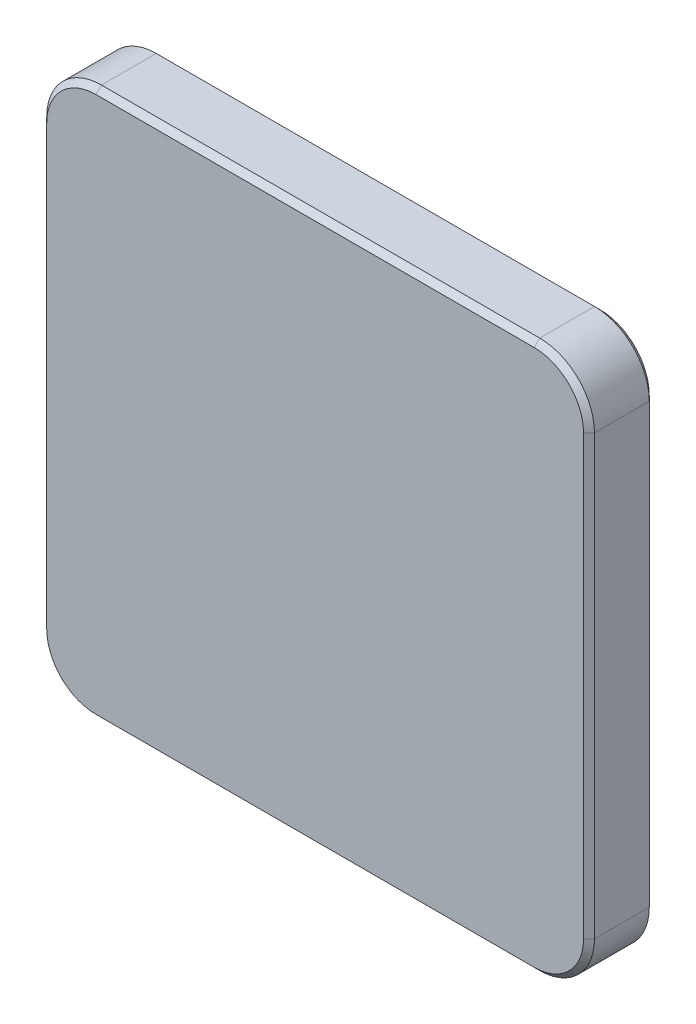
ISO-10303-21;
HEADER;
FILE_DESCRIPTION(('STEP AP214'),'2;1');
FILE_NAME('part.step','',(''),(''),'','','');
FILE_SCHEMA(('AUTOMOTIVE_DESIGN { 1 0 10303 214 1 1 1 1 }'));
ENDSEC;
DATA;
#1=APPLICATION_CONTEXT('core data for automotive mechanical design processes');
#2=APPLICATION_PROTOCOL_DEFINITION('international standard','automotive_design',2000,#1);
#3=PRODUCT_CONTEXT('',#1,'mechanical');
#4=PRODUCT('Part','Part','',(#3));
#5=PRODUCT_RELATED_PRODUCT_CATEGORY('part','',(#4));
#6=PRODUCT_DEFINITION_FORMATION('','',#4);
#7=PRODUCT_DEFINITION_CONTEXT('part definition',#1,'design');
#8=PRODUCT_DEFINITION('design','',#6,#7);
#9=PRODUCT_DEFINITION_SHAPE('','',#8);
#10=(LENGTH_UNIT() NAMED_UNIT(*) SI_UNIT(.MILLI.,.METRE.));
#11=(NAMED_UNIT(*) PLANE_ANGLE_UNIT() SI_UNIT($,.RADIAN.));
#12=(NAMED_UNIT(*) SI_UNIT($,.STERADIAN.) SOLID_ANGLE_UNIT());
#13=UNCERTAINTY_MEASURE_WITH_UNIT(LENGTH_MEASURE(1.E-05),#10,'distance_accuracy_value','');
#14=(GEOMETRIC_REPRESENTATION_CONTEXT(3) GLOBAL_UNCERTAINTY_ASSIGNED_CONTEXT((#13)) GLOBAL_UNIT_ASSIGNED_CONTEXT((#10,
#11,#12)) REPRESENTATION_CONTEXT('',''));
#15=CARTESIAN_POINT('',(0.,0.,0.));
#16=DIRECTION('',(0.,0.,1.));
#17=DIRECTION('',(1.,0.,0.));
#18=AXIS2_PLACEMENT_3D('',#15,#16,#17);
#19=CARTESIAN_POINT('',(50.,-50.,12.));
#20=DIRECTION('',(-1.,0.,0.));
#21=DIRECTION('',(0.,0.,1.));
#22=AXIS2_PLACEMENT_3D('',#19,#20,#21);
#23=PLANE('',#22);
#24=DIRECTION('',(0.,0.,-1.));
#25=VECTOR('',#24,1.);
#26=CARTESIAN_POINT('',(50.,40.,12.));
#27=LINE('',#26,#25);
#28=CARTESIAN_POINT('',(50.,40.,1.));
#29=VERTEX_POINT('',#28);
#30=CARTESIAN_POINT('',(50.,40.,11.));
#31=VERTEX_POINT('',#30);
#32=EDGE_CURVE('E294',#29,#31,#27,.F.);
#33=ORIENTED_EDGE('',*,*,#32,.T.);
#34=DIRECTION('',(0.,-1.,0.));
#35=VECTOR('',#34,1.);
#36=CARTESIAN_POINT('',(50.,-50.,11.));
#37=LINE('',#36,#35);
#38=CARTESIAN_POINT('',(50.,-40.,11.));
#39=VERTEX_POINT('',#38);
#40=EDGE_CURVE('E236',#31,#39,#37,.T.);
#41=ORIENTED_EDGE('',*,*,#40,.T.);
#42=DIRECTION('',(0.,0.,-1.));
#43=VECTOR('',#42,1.);
#44=CARTESIAN_POINT('',(50.,-40.,12.));
#45=LINE('',#44,#43);
#46=CARTESIAN_POINT('',(50.,-40.,1.));
#47=VERTEX_POINT('',#46);
#48=EDGE_CURVE('E169',#39,#47,#45,.T.);
#49=ORIENTED_EDGE('',*,*,#48,.T.);
#50=DIRECTION('',(0.,1.,0.));
#51=VECTOR('',#50,1.);
#52=CARTESIAN_POINT('',(50.,40.,1.));
#53=LINE('',#52,#51);
#54=EDGE_CURVE('E186',#47,#29,#53,.T.);
#55=ORIENTED_EDGE('',*,*,#54,.T.);
#56=EDGE_LOOP('',(#33,#41,#49,#55));
#57=FACE_BOUND('',#56,.T.);
#58=ADVANCED_FACE('F33',(#57),#23,.F.);
#59=CARTESIAN_POINT('',(-50.,50.,12.));
#60=DIRECTION('',(0.,-1.,0.));
#61=DIRECTION('',(0.,0.,-1.));
#62=AXIS2_PLACEMENT_3D('',#59,#60,#61);
#63=PLANE('',#62);
#64=DIRECTION('',(0.,0.,-1.));
#65=VECTOR('',#64,1.);
#66=CARTESIAN_POINT('',(-40.,50.,12.));
#67=LINE('',#66,#65);
#68=CARTESIAN_POINT('',(-40.,50.,1.));
#69=VERTEX_POINT('',#68);
#70=CARTESIAN_POINT('',(-40.,50.,11.));
#71=VERTEX_POINT('',#70);
#72=EDGE_CURVE('E288',#69,#71,#67,.F.);
#73=ORIENTED_EDGE('',*,*,#72,.T.);
#74=DIRECTION('',(1.,0.,0.));
#75=VECTOR('',#74,1.);
#76=CARTESIAN_POINT('',(-50.,50.,11.));
#77=LINE('',#76,#75);
#78=CARTESIAN_POINT('',(40.,50.,11.));
#79=VERTEX_POINT('',#78);
#80=EDGE_CURVE('E11',#71,#79,#77,.T.);
#81=ORIENTED_EDGE('',*,*,#80,.T.);
#82=DIRECTION('',(0.,0.,-1.));
#83=VECTOR('',#82,1.);
#84=CARTESIAN_POINT('',(40.,50.,12.));
#85=LINE('',#84,#83);
#86=CARTESIAN_POINT('',(40.,50.,1.));
#87=VERTEX_POINT('',#86);
#88=EDGE_CURVE('E284',#79,#87,#85,.T.);
#89=ORIENTED_EDGE('',*,*,#88,.T.);
#90=DIRECTION('',(-1.,0.,0.));
#91=VECTOR('',#90,1.);
#92=CARTESIAN_POINT('',(-40.,50.,1.));
#93=LINE('',#92,#91);
#94=EDGE_CURVE('E191',#87,#69,#93,.T.);
#95=ORIENTED_EDGE('',*,*,#94,.T.);
#96=EDGE_LOOP('',(#73,#81,#89,#95));
#97=FACE_BOUND('',#96,.T.);
#98=ADVANCED_FACE('F347',(#97),#63,.F.);
#99=CARTESIAN_POINT('',(-50.,-50.,12.));
#100=DIRECTION('',(1.,0.,0.));
#101=DIRECTION('',(0.,0.,-1.));
#102=AXIS2_PLACEMENT_3D('',#99,#100,#101);
#103=PLANE('',#102);
#104=DIRECTION('',(0.,0.,-1.));
#105=VECTOR('',#104,1.);
#106=CARTESIAN_POINT('',(-50.,-40.,12.));
#107=LINE('',#106,#105);
#108=CARTESIAN_POINT('',(-50.,-40.,1.));
#109=VERTEX_POINT('',#108);
#110=CARTESIAN_POINT('',(-50.,-40.,11.));
#111=VERTEX_POINT('',#110);
#112=EDGE_CURVE('E216',#109,#111,#107,.F.);
#113=ORIENTED_EDGE('',*,*,#112,.T.);
#114=DIRECTION('',(0.,1.,0.));
#115=VECTOR('',#114,1.);
#116=CARTESIAN_POINT('',(-50.,-50.,11.));
#117=LINE('',#116,#115);
#118=CARTESIAN_POINT('',(-50.,40.,11.));
#119=VERTEX_POINT('',#118);
#120=EDGE_CURVE('E57',#111,#119,#117,.T.);
#121=ORIENTED_EDGE('',*,*,#120,.T.);
#122=DIRECTION('',(0.,0.,-1.));
#123=VECTOR('',#122,1.);
#124=CARTESIAN_POINT('',(-50.,40.,12.));
#125=LINE('',#124,#123);
#126=CARTESIAN_POINT('',(-50.,40.,1.));
#127=VERTEX_POINT('',#126);
#128=EDGE_CURVE('E282',#119,#127,#125,.T.);
#129=ORIENTED_EDGE('',*,*,#128,.T.);
#130=DIRECTION('',(0.,-1.,0.));
#131=VECTOR('',#130,1.);
#132=CARTESIAN_POINT('',(-50.,-40.,1.));
#133=LINE('',#132,#131);
#134=EDGE_CURVE('E196',#127,#109,#133,.T.);
#135=ORIENTED_EDGE('',*,*,#134,.T.);
#136=EDGE_LOOP('',(#113,#121,#129,#135));
#137=FACE_BOUND('',#136,.T.);
#138=ADVANCED_FACE('F281',(#137),#103,.F.);
#139=CARTESIAN_POINT('',(-50.,-50.,12.));
#140=DIRECTION('',(0.,1.,0.));
#141=DIRECTION('',(0.,0.,1.));
#142=AXIS2_PLACEMENT_3D('',#139,#140,#141);
#143=PLANE('',#142);
#144=DIRECTION('',(0.,0.,-1.));
#145=VECTOR('',#144,1.);
#146=CARTESIAN_POINT('',(40.,-50.,12.));
#147=LINE('',#146,#145);
#148=CARTESIAN_POINT('',(40.,-50.,1.));
#149=VERTEX_POINT('',#148);
#150=CARTESIAN_POINT('',(40.,-50.,11.));
#151=VERTEX_POINT('',#150);
#152=EDGE_CURVE('E290',#149,#151,#147,.F.);
#153=ORIENTED_EDGE('',*,*,#152,.T.);
#154=DIRECTION('',(-1.,0.,0.));
#155=VECTOR('',#154,1.);
#156=CARTESIAN_POINT('',(-50.,-50.,11.));
#157=LINE('',#156,#155);
#158=CARTESIAN_POINT('',(-40.,-50.,11.));
#159=VERTEX_POINT('',#158);
#160=EDGE_CURVE('E240',#151,#159,#157,.T.);
#161=ORIENTED_EDGE('',*,*,#160,.T.);
#162=DIRECTION('',(0.,0.,-1.));
#163=VECTOR('',#162,1.);
#164=CARTESIAN_POINT('',(-40.,-50.,12.));
#165=LINE('',#164,#163);
#166=CARTESIAN_POINT('',(-40.,-50.,1.));
#167=VERTEX_POINT('',#166);
#168=EDGE_CURVE('E280',#159,#167,#165,.T.);
#169=ORIENTED_EDGE('',*,*,#168,.T.);
#170=DIRECTION('',(1.,0.,0.));
#171=VECTOR('',#170,1.);
#172=CARTESIAN_POINT('',(40.,-50.,1.));
#173=LINE('',#172,#171);
#174=EDGE_CURVE('E176',#167,#149,#173,.T.);
#175=ORIENTED_EDGE('',*,*,#174,.T.);
#176=EDGE_LOOP('',(#153,#161,#169,#175));
#177=FACE_BOUND('',#176,.T.);
#178=ADVANCED_FACE('F316',(#177),#143,.F.);
#179=CARTESIAN_POINT('',(0.,0.,12.));
#180=DIRECTION('',(0.,0.,-1.));
#181=DIRECTION('',(-1.,0.,0.));
#182=AXIS2_PLACEMENT_3D('',#179,#180,#181);
#183=PLANE('',#182);
#184=DIRECTION('',(0.,1.,0.));
#185=VECTOR('',#184,1.);
#186=CARTESIAN_POINT('',(49.,0.,12.));
#187=LINE('',#186,#185);
#188=CARTESIAN_POINT('',(49.,-40.,12.));
#189=VERTEX_POINT('',#188);
#190=CARTESIAN_POINT('',(49.,40.,12.));
#191=VERTEX_POINT('',#190);
#192=EDGE_CURVE('E228',#189,#191,#187,.T.);
#193=ORIENTED_EDGE('',*,*,#192,.T.);
#194=CARTESIAN_POINT('',(40.,40.,12.));
#195=DIRECTION('',(0.,0.,-1.));
#196=DIRECTION('',(-1.,0.,0.));
#197=AXIS2_PLACEMENT_3D('',#194,#195,#196);
#198=CIRCLE('',#197,8.99999999999999);
#199=CARTESIAN_POINT('',(40.,49.,12.));
#200=VERTEX_POINT('',#199);
#201=EDGE_CURVE('E230',#191,#200,#198,.F.);
#202=ORIENTED_EDGE('',*,*,#201,.T.);
#203=DIRECTION('',(-1.,0.,0.));
#204=VECTOR('',#203,1.);
#205=CARTESIAN_POINT('',(0.,49.,12.));
#206=LINE('',#205,#204);
#207=CARTESIAN_POINT('',(-40.,49.,12.));
#208=VERTEX_POINT('',#207);
#209=EDGE_CURVE('E197',#200,#208,#206,.T.);
#210=ORIENTED_EDGE('',*,*,#209,.T.);
#211=CARTESIAN_POINT('',(-40.,40.,12.));
#212=DIRECTION('',(0.,0.,-1.));
#213=DIRECTION('',(-1.,0.,0.));
#214=AXIS2_PLACEMENT_3D('',#211,#212,#213);
#215=CIRCLE('',#214,8.99999999999999);
#216=CARTESIAN_POINT('',(-49.,40.,12.));
#217=VERTEX_POINT('',#216);
#218=EDGE_CURVE('E218',#208,#217,#215,.F.);
#219=ORIENTED_EDGE('',*,*,#218,.T.);
#220=DIRECTION('',(0.,-1.,0.));
#221=VECTOR('',#220,1.);
#222=CARTESIAN_POINT('',(-49.,0.,12.));
#223=LINE('',#222,#221);
#224=CARTESIAN_POINT('',(-49.,-40.,12.));
#225=VERTEX_POINT('',#224);
#226=EDGE_CURVE('E220',#217,#225,#223,.T.);
#227=ORIENTED_EDGE('',*,*,#226,.T.);
#228=CARTESIAN_POINT('',(-40.,-40.,12.));
#229=DIRECTION('',(0.,0.,-1.));
#230=DIRECTION('',(-1.,0.,0.));
#231=AXIS2_PLACEMENT_3D('',#228,#229,#230);
#232=CIRCLE('',#231,8.99999999999999);
#233=CARTESIAN_POINT('',(-40.,-49.,12.));
#234=VERTEX_POINT('',#233);
#235=EDGE_CURVE('E222',#225,#234,#232,.F.);
#236=ORIENTED_EDGE('',*,*,#235,.T.);
#237=DIRECTION('',(1.,0.,0.));
#238=VECTOR('',#237,1.);
#239=CARTESIAN_POINT('',(0.,-49.,12.));
#240=LINE('',#239,#238);
#241=CARTESIAN_POINT('',(40.,-49.,12.));
#242=VERTEX_POINT('',#241);
#243=EDGE_CURVE('E224',#234,#242,#240,.T.);
#244=ORIENTED_EDGE('',*,*,#243,.T.);
#245=CARTESIAN_POINT('',(40.,-40.,12.));
#246=DIRECTION('',(0.,0.,-1.));
#247=DIRECTION('',(-1.,0.,0.));
#248=AXIS2_PLACEMENT_3D('',#245,#246,#247);
#249=CIRCLE('',#248,8.99999999999999);
#250=EDGE_CURVE('E226',#242,#189,#249,.F.);
#251=ORIENTED_EDGE('',*,*,#250,.T.);
#252=EDGE_LOOP('',(#193,#202,#210,#219,#227,#236,#244,#251));
#253=FACE_BOUND('',#252,.T.);
#254=ADVANCED_FACE('F333',(#253),#183,.F.);
#255=CARTESIAN_POINT('',(0.,0.,0.));
#256=DIRECTION('',(0.,0.,-1.));
#257=DIRECTION('',(-1.,0.,0.));
#258=AXIS2_PLACEMENT_3D('',#255,#256,#257);
#259=PLANE('',#258);
#260=DIRECTION('',(-1.,0.,0.));
#261=VECTOR('',#260,1.);
#262=CARTESIAN_POINT('',(-40.,-49.,0.));
#263=LINE('',#262,#261);
#264=CARTESIAN_POINT('',(40.,-49.,0.));
#265=VERTEX_POINT('',#264);
#266=CARTESIAN_POINT('',(-40.,-49.,0.));
#267=VERTEX_POINT('',#266);
#268=EDGE_CURVE('E173',#265,#267,#263,.T.);
#269=ORIENTED_EDGE('',*,*,#268,.T.);
#270=CARTESIAN_POINT('',(-40.,-40.,0.));
#271=DIRECTION('',(0.,0.,-1.));
#272=DIRECTION('',(-1.,0.,0.));
#273=AXIS2_PLACEMENT_3D('',#270,#271,#272);
#274=CIRCLE('',#273,9.);
#275=CARTESIAN_POINT('',(-49.,-40.,0.));
#276=VERTEX_POINT('',#275);
#277=EDGE_CURVE('E154',#267,#276,#274,.T.);
#278=ORIENTED_EDGE('',*,*,#277,.T.);
#279=DIRECTION('',(0.,1.,0.));
#280=VECTOR('',#279,1.);
#281=CARTESIAN_POINT('',(-49.,40.,0.));
#282=LINE('',#281,#280);
#283=CARTESIAN_POINT('',(-49.,40.,0.));
#284=VERTEX_POINT('',#283);
#285=EDGE_CURVE('E162',#276,#284,#282,.T.);
#286=ORIENTED_EDGE('',*,*,#285,.T.);
#287=CARTESIAN_POINT('',(-40.,40.,0.));
#288=DIRECTION('',(0.,0.,-1.));
#289=DIRECTION('',(-1.,0.,0.));
#290=AXIS2_PLACEMENT_3D('',#287,#288,#289);
#291=CIRCLE('',#290,9.);
#292=CARTESIAN_POINT('',(-40.,49.,0.));
#293=VERTEX_POINT('',#292);
#294=EDGE_CURVE('E168',#284,#293,#291,.T.);
#295=ORIENTED_EDGE('',*,*,#294,.T.);
#296=DIRECTION('',(1.,0.,0.));
#297=VECTOR('',#296,1.);
#298=CARTESIAN_POINT('',(40.,49.,0.));
#299=LINE('',#298,#297);
#300=CARTESIAN_POINT('',(40.,49.,0.));
#301=VERTEX_POINT('',#300);
#302=EDGE_CURVE('E299',#293,#301,#299,.T.);
#303=ORIENTED_EDGE('',*,*,#302,.T.);
#304=CARTESIAN_POINT('',(40.,40.,0.));
#305=DIRECTION('',(0.,0.,-1.));
#306=DIRECTION('',(-1.,0.,0.));
#307=AXIS2_PLACEMENT_3D('',#304,#305,#306);
#308=CIRCLE('',#307,9.);
#309=CARTESIAN_POINT('',(49.,40.,0.));
#310=VERTEX_POINT('',#309);
#311=EDGE_CURVE('E301',#301,#310,#308,.T.);
#312=ORIENTED_EDGE('',*,*,#311,.T.);
#313=DIRECTION('',(0.,-1.,0.));
#314=VECTOR('',#313,1.);
#315=CARTESIAN_POINT('',(49.,-40.,0.));
#316=LINE('',#315,#314);
#317=CARTESIAN_POINT('',(49.,-40.,0.));
#318=VERTEX_POINT('',#317);
#319=EDGE_CURVE('E303',#310,#318,#316,.T.);
#320=ORIENTED_EDGE('',*,*,#319,.T.);
#321=CARTESIAN_POINT('',(40.,-40.,0.));
#322=DIRECTION('',(0.,0.,-1.));
#323=DIRECTION('',(-1.,0.,0.));
#324=AXIS2_PLACEMENT_3D('',#321,#322,#323);
#325=CIRCLE('',#324,9.);
#326=EDGE_CURVE('E178',#318,#265,#325,.T.);
#327=ORIENTED_EDGE('',*,*,#326,.T.);
#328=EDGE_LOOP('',(#269,#278,#286,#295,#303,#312,#320,#327));
#329=FACE_BOUND('',#328,.T.);
#330=ADVANCED_FACE('F171',(#329),#259,.T.);
#331=CARTESIAN_POINT('',(-40.,40.,12.));
#332=DIRECTION('',(0.,0.,-1.));
#333=DIRECTION('',(-1.,0.,0.));
#334=AXIS2_PLACEMENT_3D('',#331,#332,#333);
#335=CYLINDRICAL_SURFACE('',#334,10.);
#336=ORIENTED_EDGE('',*,*,#128,.F.);
#337=CARTESIAN_POINT('',(-40.,40.,11.));
#338=DIRECTION('',(0.,0.,-1.));
#339=DIRECTION('',(-1.,0.,0.));
#340=AXIS2_PLACEMENT_3D('',#337,#338,#339);
#341=CIRCLE('',#340,10.);
#342=EDGE_CURVE('E42',#119,#71,#341,.T.);
#343=ORIENTED_EDGE('',*,*,#342,.T.);
#344=ORIENTED_EDGE('',*,*,#72,.F.);
#345=CARTESIAN_POINT('',(-40.,40.,1.));
#346=DIRECTION('',(0.,0.,-1.));
#347=DIRECTION('',(-1.,0.,0.));
#348=AXIS2_PLACEMENT_3D('',#345,#346,#347);
#349=CIRCLE('',#348,10.);
#350=EDGE_CURVE('E193',#69,#127,#349,.F.);
#351=ORIENTED_EDGE('',*,*,#350,.T.);
#352=EDGE_LOOP('',(#336,#343,#344,#351));
#353=FACE_BOUND('',#352,.T.);
#354=ADVANCED_FACE('F372',(#353),#335,.T.);
#355=CARTESIAN_POINT('',(-40.,-40.,12.));
#356=DIRECTION('',(0.,0.,-1.));
#357=DIRECTION('',(-1.,0.,0.));
#358=AXIS2_PLACEMENT_3D('',#355,#356,#357);
#359=CYLINDRICAL_SURFACE('',#358,10.);
#360=ORIENTED_EDGE('',*,*,#168,.F.);
#361=CARTESIAN_POINT('',(-40.,-40.,11.));
#362=DIRECTION('',(0.,0.,-1.));
#363=DIRECTION('',(-1.,0.,0.));
#364=AXIS2_PLACEMENT_3D('',#361,#362,#363);
#365=CIRCLE('',#364,10.);
#366=EDGE_CURVE('E242',#159,#111,#365,.T.);
#367=ORIENTED_EDGE('',*,*,#366,.T.);
#368=ORIENTED_EDGE('',*,*,#112,.F.);
#369=CARTESIAN_POINT('',(-40.,-40.,1.));
#370=DIRECTION('',(0.,0.,-1.));
#371=DIRECTION('',(-1.,0.,0.));
#372=AXIS2_PLACEMENT_3D('',#369,#370,#371);
#373=CIRCLE('',#372,10.);
#374=EDGE_CURVE('E156',#109,#167,#373,.F.);
#375=ORIENTED_EDGE('',*,*,#374,.T.);
#376=EDGE_LOOP('',(#360,#367,#368,#375));
#377=FACE_BOUND('',#376,.T.);
#378=ADVANCED_FACE('F279',(#377),#359,.T.);
#379=CARTESIAN_POINT('',(40.,-40.,12.));
#380=DIRECTION('',(0.,0.,-1.));
#381=DIRECTION('',(-1.,0.,0.));
#382=AXIS2_PLACEMENT_3D('',#379,#380,#381);
#383=CYLINDRICAL_SURFACE('',#382,10.);
#384=ORIENTED_EDGE('',*,*,#48,.F.);
#385=CARTESIAN_POINT('',(40.,-40.,11.));
#386=DIRECTION('',(0.,0.,-1.));
#387=DIRECTION('',(-1.,0.,0.));
#388=AXIS2_PLACEMENT_3D('',#385,#386,#387);
#389=CIRCLE('',#388,10.);
#390=EDGE_CURVE('E238',#39,#151,#389,.T.);
#391=ORIENTED_EDGE('',*,*,#390,.T.);
#392=ORIENTED_EDGE('',*,*,#152,.F.);
#393=CARTESIAN_POINT('',(40.,-40.,1.));
#394=DIRECTION('',(0.,0.,-1.));
#395=DIRECTION('',(-1.,0.,0.));
#396=AXIS2_PLACEMENT_3D('',#393,#394,#395);
#397=CIRCLE('',#396,10.);
#398=EDGE_CURVE('E183',#149,#47,#397,.F.);
#399=ORIENTED_EDGE('',*,*,#398,.T.);
#400=EDGE_LOOP('',(#384,#391,#392,#399));
#401=FACE_BOUND('',#400,.T.);
#402=ADVANCED_FACE('F319',(#401),#383,.T.);
#403=CARTESIAN_POINT('',(40.,40.,12.));
#404=DIRECTION('',(0.,0.,-1.));
#405=DIRECTION('',(-1.,0.,0.));
#406=AXIS2_PLACEMENT_3D('',#403,#404,#405);
#407=CYLINDRICAL_SURFACE('',#406,10.);
#408=ORIENTED_EDGE('',*,*,#88,.F.);
#409=CARTESIAN_POINT('',(40.,40.,11.));
#410=DIRECTION('',(0.,0.,-1.));
#411=DIRECTION('',(-1.,0.,0.));
#412=AXIS2_PLACEMENT_3D('',#409,#410,#411);
#413=CIRCLE('',#412,10.);
#414=EDGE_CURVE('E233',#79,#31,#413,.T.);
#415=ORIENTED_EDGE('',*,*,#414,.T.);
#416=ORIENTED_EDGE('',*,*,#32,.F.);
#417=CARTESIAN_POINT('',(40.,40.,1.));
#418=DIRECTION('',(0.,0.,-1.));
#419=DIRECTION('',(-1.,0.,0.));
#420=AXIS2_PLACEMENT_3D('',#417,#418,#419);
#421=CIRCLE('',#420,10.);
#422=EDGE_CURVE('E188',#29,#87,#421,.F.);
#423=ORIENTED_EDGE('',*,*,#422,.T.);
#424=EDGE_LOOP('',(#408,#415,#416,#423));
#425=FACE_BOUND('',#424,.T.);
#426=ADVANCED_FACE('F350',(#425),#407,.T.);
#427=CARTESIAN_POINT('',(40.,40.,0.));
#428=DIRECTION('',(0.,0.,1.));
#429=DIRECTION('',(1.,0.,0.));
#430=AXIS2_PLACEMENT_3D('',#427,#428,#429);
#431=CONICAL_SURFACE('',#430,9.,0.785398163397447);
#432=DIRECTION('',(0.,-0.707106781186547,-0.707106781186547));
#433=VECTOR('',#432,1.);
#434=CARTESIAN_POINT('',(40.,50.,1.));
#435=LINE('',#434,#433);
#436=EDGE_CURVE('E210',#87,#301,#435,.T.);
#437=ORIENTED_EDGE('',*,*,#436,.F.);
#438=ORIENTED_EDGE('',*,*,#422,.F.);
#439=DIRECTION('',(0.707106781186547,0.,0.707106781186547));
#440=VECTOR('',#439,1.);
#441=CARTESIAN_POINT('',(49.,40.,0.));
#442=LINE('',#441,#440);
#443=EDGE_CURVE('E213',#310,#29,#442,.T.);
#444=ORIENTED_EDGE('',*,*,#443,.F.);
#445=ORIENTED_EDGE('',*,*,#311,.F.);
#446=EDGE_LOOP('',(#437,#438,#444,#445));
#447=FACE_BOUND('',#446,.T.);
#448=ADVANCED_FACE('F381',(#447),#431,.T.);
#449=CARTESIAN_POINT('',(50.,-50.,1.));
#450=DIRECTION('',(0.707106781186547,0.,-0.707106781186547));
#451=DIRECTION('',(0.,-1.,0.));
#452=AXIS2_PLACEMENT_3D('',#449,#450,#451);
#453=PLANE('',#452);
#454=ORIENTED_EDGE('',*,*,#443,.T.);
#455=ORIENTED_EDGE('',*,*,#54,.F.);
#456=DIRECTION('',(0.707106781186547,0.,0.707106781186547));
#457=VECTOR('',#456,1.);
#458=CARTESIAN_POINT('',(49.,-40.,0.));
#459=LINE('',#458,#457);
#460=EDGE_CURVE('E207',#318,#47,#459,.T.);
#461=ORIENTED_EDGE('',*,*,#460,.F.);
#462=ORIENTED_EDGE('',*,*,#319,.F.);
#463=EDGE_LOOP('',(#454,#455,#461,#462));
#464=FACE_BOUND('',#463,.T.);
#465=ADVANCED_FACE('F397',(#464),#453,.T.);
#466=CARTESIAN_POINT('',(-50.,50.,1.));
#467=DIRECTION('',(0.,0.707106781186547,-0.707106781186547));
#468=DIRECTION('',(1.,0.,0.));
#469=AXIS2_PLACEMENT_3D('',#466,#467,#468);
#470=PLANE('',#469);
#471=ORIENTED_EDGE('',*,*,#436,.T.);
#472=ORIENTED_EDGE('',*,*,#302,.F.);
#473=DIRECTION('',(0.,-0.707106781186547,-0.707106781186547));
#474=VECTOR('',#473,1.);
#475=CARTESIAN_POINT('',(-40.,50.,1.));
#476=LINE('',#475,#474);
#477=EDGE_CURVE('E204',#69,#293,#476,.T.);
#478=ORIENTED_EDGE('',*,*,#477,.F.);
#479=ORIENTED_EDGE('',*,*,#94,.F.);
#480=EDGE_LOOP('',(#471,#472,#478,#479));
#481=FACE_BOUND('',#480,.T.);
#482=ADVANCED_FACE('F394',(#481),#470,.T.);
#483=CARTESIAN_POINT('',(40.,-40.,0.));
#484=DIRECTION('',(0.,0.,1.));
#485=DIRECTION('',(1.,0.,0.));
#486=AXIS2_PLACEMENT_3D('',#483,#484,#485);
#487=CONICAL_SURFACE('',#486,9.,0.785398163397447);
#488=ORIENTED_EDGE('',*,*,#460,.T.);
#489=ORIENTED_EDGE('',*,*,#398,.F.);
#490=DIRECTION('',(0.,-0.707106781186547,0.707106781186547));
#491=VECTOR('',#490,1.);
#492=CARTESIAN_POINT('',(40.,-49.,0.));
#493=LINE('',#492,#491);
#494=EDGE_CURVE('E201',#265,#149,#493,.T.);
#495=ORIENTED_EDGE('',*,*,#494,.F.);
#496=ORIENTED_EDGE('',*,*,#326,.F.);
#497=EDGE_LOOP('',(#488,#489,#495,#496));
#498=FACE_BOUND('',#497,.T.);
#499=ADVANCED_FACE('F310',(#498),#487,.T.);
#500=CARTESIAN_POINT('',(-40.,40.,0.));
#501=DIRECTION('',(0.,0.,1.));
#502=DIRECTION('',(1.,0.,0.));
#503=AXIS2_PLACEMENT_3D('',#500,#501,#502);
#504=CONICAL_SURFACE('',#503,9.,0.785398163397447);
#505=ORIENTED_EDGE('',*,*,#477,.T.);
#506=ORIENTED_EDGE('',*,*,#294,.F.);
#507=DIRECTION('',(0.707106781186547,0.,-0.707106781186547));
#508=VECTOR('',#507,1.);
#509=CARTESIAN_POINT('',(-50.,40.,1.));
#510=LINE('',#509,#508);
#511=EDGE_CURVE('E165',#127,#284,#510,.T.);
#512=ORIENTED_EDGE('',*,*,#511,.F.);
#513=ORIENTED_EDGE('',*,*,#350,.F.);
#514=EDGE_LOOP('',(#505,#506,#512,#513));
#515=FACE_BOUND('',#514,.T.);
#516=ADVANCED_FACE('F388',(#515),#504,.T.);
#517=CARTESIAN_POINT('',(-50.,-50.,1.));
#518=DIRECTION('',(0.,-0.707106781186547,-0.707106781186547));
#519=DIRECTION('',(-1.,0.,0.));
#520=AXIS2_PLACEMENT_3D('',#517,#518,#519);
#521=PLANE('',#520);
#522=ORIENTED_EDGE('',*,*,#494,.T.);
#523=ORIENTED_EDGE('',*,*,#174,.F.);
#524=DIRECTION('',(0.,-0.707106781186547,0.707106781186547));
#525=VECTOR('',#524,1.);
#526=CARTESIAN_POINT('',(-40.,-49.,0.));
#527=LINE('',#526,#525);
#528=EDGE_CURVE('E159',#267,#167,#527,.T.);
#529=ORIENTED_EDGE('',*,*,#528,.F.);
#530=ORIENTED_EDGE('',*,*,#268,.F.);
#531=EDGE_LOOP('',(#522,#523,#529,#530));
#532=FACE_BOUND('',#531,.T.);
#533=ADVANCED_FACE('F313',(#532),#521,.T.);
#534=CARTESIAN_POINT('',(-50.,-50.,1.));
#535=DIRECTION('',(-0.707106781186547,0.,-0.707106781186547));
#536=DIRECTION('',(0.,1.,0.));
#537=AXIS2_PLACEMENT_3D('',#534,#535,#536);
#538=PLANE('',#537);
#539=ORIENTED_EDGE('',*,*,#511,.T.);
#540=ORIENTED_EDGE('',*,*,#285,.F.);
#541=DIRECTION('',(0.707106781186547,0.,-0.707106781186547));
#542=VECTOR('',#541,1.);
#543=CARTESIAN_POINT('',(-50.,-40.,1.));
#544=LINE('',#543,#542);
#545=EDGE_CURVE('E149',#109,#276,#544,.T.);
#546=ORIENTED_EDGE('',*,*,#545,.F.);
#547=ORIENTED_EDGE('',*,*,#134,.F.);
#548=EDGE_LOOP('',(#539,#540,#546,#547));
#549=FACE_BOUND('',#548,.T.);
#550=ADVANCED_FACE('F163',(#549),#538,.T.);
#551=CARTESIAN_POINT('',(-40.,-40.,0.));
#552=DIRECTION('',(0.,0.,1.));
#553=DIRECTION('',(1.,0.,0.));
#554=AXIS2_PLACEMENT_3D('',#551,#552,#553);
#555=CONICAL_SURFACE('',#554,9.,0.785398163397447);
#556=ORIENTED_EDGE('',*,*,#528,.T.);
#557=ORIENTED_EDGE('',*,*,#374,.F.);
#558=ORIENTED_EDGE('',*,*,#545,.T.);
#559=ORIENTED_EDGE('',*,*,#277,.F.);
#560=EDGE_LOOP('',(#556,#557,#558,#559));
#561=FACE_BOUND('',#560,.T.);
#562=ADVANCED_FACE('F152',(#561),#555,.T.);
#563=CARTESIAN_POINT('',(-40.,-40.,12.));
#564=DIRECTION('',(0.,0.,-1.));
#565=DIRECTION('',(-1.,0.,0.));
#566=AXIS2_PLACEMENT_3D('',#563,#564,#565);
#567=CONICAL_SURFACE('',#566,8.99999999999999,0.785398163397447);
#568=DIRECTION('',(0.707106781186547,0.,0.707106781186547));
#569=VECTOR('',#568,1.);
#570=CARTESIAN_POINT('',(-50.,-40.,11.));
#571=LINE('',#570,#569);
#572=EDGE_CURVE('E261',#111,#225,#571,.T.);
#573=ORIENTED_EDGE('',*,*,#572,.F.);
#574=ORIENTED_EDGE('',*,*,#366,.F.);
#575=DIRECTION('',(0.,-0.707106781186547,-0.707106781186547));
#576=VECTOR('',#575,1.);
#577=CARTESIAN_POINT('',(-40.,-49.,12.));
#578=LINE('',#577,#576);
#579=EDGE_CURVE('E37',#234,#159,#578,.T.);
#580=ORIENTED_EDGE('',*,*,#579,.F.);
#581=ORIENTED_EDGE('',*,*,#235,.F.);
#582=EDGE_LOOP('',(#573,#574,#580,#581));
#583=FACE_BOUND('',#582,.T.);
#584=ADVANCED_FACE('F35',(#583),#567,.T.);
#585=CARTESIAN_POINT('',(0.,-49.,12.));
#586=DIRECTION('',(0.,0.707106781186547,-0.707106781186547));
#587=DIRECTION('',(1.,0.,0.));
#588=AXIS2_PLACEMENT_3D('',#585,#586,#587);
#589=PLANE('',#588);
#590=ORIENTED_EDGE('',*,*,#579,.T.);
#591=ORIENTED_EDGE('',*,*,#160,.F.);
#592=DIRECTION('',(0.,-0.707106781186547,-0.707106781186547));
#593=VECTOR('',#592,1.);
#594=CARTESIAN_POINT('',(40.,-49.,12.));
#595=LINE('',#594,#593);
#596=EDGE_CURVE('E259',#242,#151,#595,.T.);
#597=ORIENTED_EDGE('',*,*,#596,.F.);
#598=ORIENTED_EDGE('',*,*,#243,.F.);
#599=EDGE_LOOP('',(#590,#591,#597,#598));
#600=FACE_BOUND('',#599,.T.);
#601=ADVANCED_FACE('F271',(#600),#589,.F.);
#602=CARTESIAN_POINT('',(-49.,0.,12.));
#603=DIRECTION('',(0.707106781186547,0.,-0.707106781186547));
#604=DIRECTION('',(0.,-1.,0.));
#605=AXIS2_PLACEMENT_3D('',#602,#603,#604);
#606=PLANE('',#605);
#607=ORIENTED_EDGE('',*,*,#572,.T.);
#608=ORIENTED_EDGE('',*,*,#226,.F.);
#609=DIRECTION('',(0.707106781186547,0.,0.707106781186547));
#610=VECTOR('',#609,1.);
#611=CARTESIAN_POINT('',(-50.,40.,11.));
#612=LINE('',#611,#610);
#613=EDGE_CURVE('E256',#119,#217,#612,.T.);
#614=ORIENTED_EDGE('',*,*,#613,.F.);
#615=ORIENTED_EDGE('',*,*,#120,.F.);
#616=EDGE_LOOP('',(#607,#608,#614,#615));
#617=FACE_BOUND('',#616,.T.);
#618=ADVANCED_FACE('F336',(#617),#606,.F.);
#619=CARTESIAN_POINT('',(40.,-40.,12.));
#620=DIRECTION('',(0.,0.,-1.));
#621=DIRECTION('',(-1.,0.,0.));
#622=AXIS2_PLACEMENT_3D('',#619,#620,#621);
#623=CONICAL_SURFACE('',#622,8.99999999999999,0.785398163397447);
#624=ORIENTED_EDGE('',*,*,#596,.T.);
#625=ORIENTED_EDGE('',*,*,#390,.F.);
#626=DIRECTION('',(0.707106781186547,0.,-0.707106781186547));
#627=VECTOR('',#626,1.);
#628=CARTESIAN_POINT('',(49.,-40.,12.));
#629=LINE('',#628,#627);
#630=EDGE_CURVE('E253',#189,#39,#629,.T.);
#631=ORIENTED_EDGE('',*,*,#630,.F.);
#632=ORIENTED_EDGE('',*,*,#250,.F.);
#633=EDGE_LOOP('',(#624,#625,#631,#632));
#634=FACE_BOUND('',#633,.T.);
#635=ADVANCED_FACE('F324',(#634),#623,.T.);
#636=CARTESIAN_POINT('',(-40.,40.,12.));
#637=DIRECTION('',(0.,0.,-1.));
#638=DIRECTION('',(-1.,0.,0.));
#639=AXIS2_PLACEMENT_3D('',#636,#637,#638);
#640=CONICAL_SURFACE('',#639,8.99999999999999,0.785398163397447);
#641=ORIENTED_EDGE('',*,*,#613,.T.);
#642=ORIENTED_EDGE('',*,*,#218,.F.);
#643=DIRECTION('',(0.,-0.707106781186547,0.707106781186547));
#644=VECTOR('',#643,1.);
#645=CARTESIAN_POINT('',(-40.,50.,11.));
#646=LINE('',#645,#644);
#647=EDGE_CURVE('E250',#71,#208,#646,.T.);
#648=ORIENTED_EDGE('',*,*,#647,.F.);
#649=ORIENTED_EDGE('',*,*,#342,.F.);
#650=EDGE_LOOP('',(#641,#642,#648,#649));
#651=FACE_BOUND('',#650,.T.);
#652=ADVANCED_FACE('F338',(#651),#640,.T.);
#653=CARTESIAN_POINT('',(49.,0.,12.));
#654=DIRECTION('',(-0.707106781186547,0.,-0.707106781186547));
#655=DIRECTION('',(0.,1.,0.));
#656=AXIS2_PLACEMENT_3D('',#653,#654,#655);
#657=PLANE('',#656);
#658=ORIENTED_EDGE('',*,*,#630,.T.);
#659=ORIENTED_EDGE('',*,*,#40,.F.);
#660=DIRECTION('',(0.707106781186547,0.,-0.707106781186547));
#661=VECTOR('',#660,1.);
#662=CARTESIAN_POINT('',(49.,40.,12.));
#663=LINE('',#662,#661);
#664=EDGE_CURVE('E248',#191,#31,#663,.T.);
#665=ORIENTED_EDGE('',*,*,#664,.F.);
#666=ORIENTED_EDGE('',*,*,#192,.F.);
#667=EDGE_LOOP('',(#658,#659,#665,#666));
#668=FACE_BOUND('',#667,.T.);
#669=ADVANCED_FACE('F329',(#668),#657,.F.);
#670=CARTESIAN_POINT('',(0.,49.,12.));
#671=DIRECTION('',(0.,-0.707106781186547,-0.707106781186547));
#672=DIRECTION('',(-1.,0.,0.));
#673=AXIS2_PLACEMENT_3D('',#670,#671,#672);
#674=PLANE('',#673);
#675=ORIENTED_EDGE('',*,*,#647,.T.);
#676=ORIENTED_EDGE('',*,*,#209,.F.);
#677=DIRECTION('',(0.,-0.707106781186547,0.707106781186547));
#678=VECTOR('',#677,1.);
#679=CARTESIAN_POINT('',(40.,50.,11.));
#680=LINE('',#679,#678);
#681=EDGE_CURVE('E246',#79,#200,#680,.T.);
#682=ORIENTED_EDGE('',*,*,#681,.F.);
#683=ORIENTED_EDGE('',*,*,#80,.F.);
#684=EDGE_LOOP('',(#675,#676,#682,#683));
#685=FACE_BOUND('',#684,.T.);
#686=ADVANCED_FACE('F344',(#685),#674,.F.);
#687=CARTESIAN_POINT('',(40.,40.,12.));
#688=DIRECTION('',(0.,0.,-1.));
#689=DIRECTION('',(-1.,0.,0.));
#690=AXIS2_PLACEMENT_3D('',#687,#688,#689);
#691=CONICAL_SURFACE('',#690,8.99999999999999,0.785398163397447);
#692=ORIENTED_EDGE('',*,*,#664,.T.);
#693=ORIENTED_EDGE('',*,*,#414,.F.);
#694=ORIENTED_EDGE('',*,*,#681,.T.);
#695=ORIENTED_EDGE('',*,*,#201,.F.);
#696=EDGE_LOOP('',(#692,#693,#694,#695));
#697=FACE_BOUND('',#696,.T.);
#698=ADVANCED_FACE('F355',(#697),#691,.T.);
#699=CLOSED_SHELL('',(#58,#98,#138,#178,#254,#330,#354,#378,#402,#426,#448,#465,#482,#499,#516,
#533,#550,#562,#584,#601,#618,#635,#652,#669,#686,#698));
#700=MANIFOLD_SOLID_BREP('B2',#699);
#701=ADVANCED_BREP_SHAPE_REPRESENTATION('',(#18,#700),#14);
#702=SHAPE_DEFINITION_REPRESENTATION(#9,#701);
ENDSEC;
END-ISO-10303-21;
